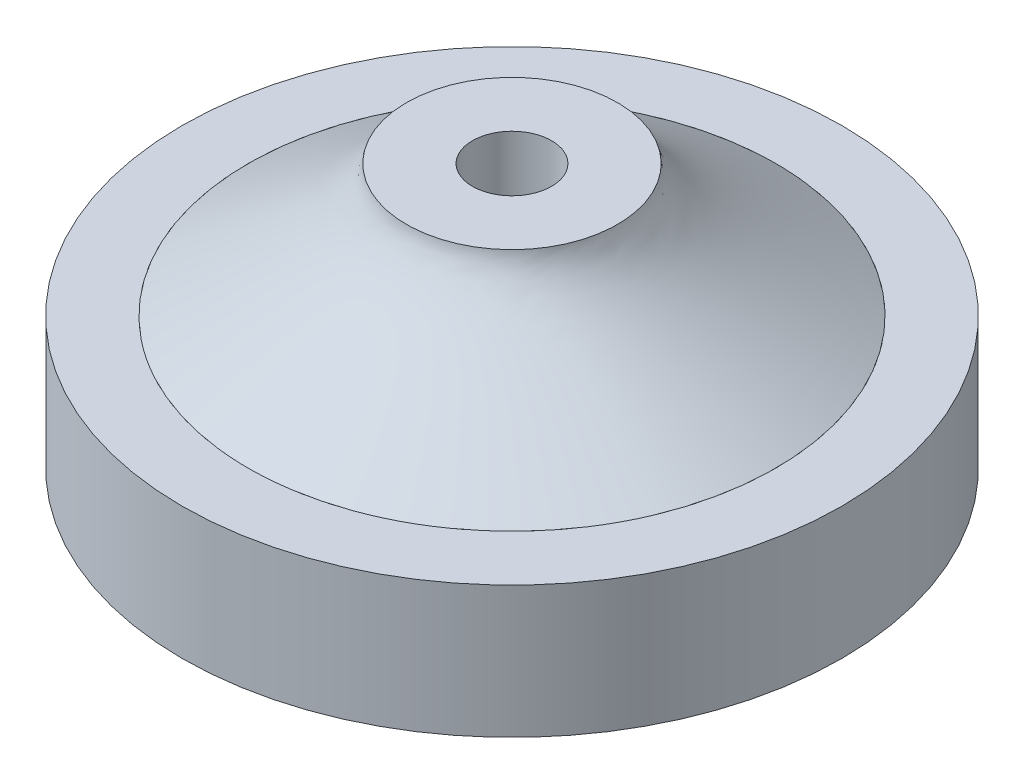
ISO-10303-21;
HEADER;
FILE_DESCRIPTION(('STEP AP214'),'2;1');
FILE_NAME('part.step','',(''),(''),'','','');
FILE_SCHEMA(('AUTOMOTIVE_DESIGN { 1 0 10303 214 1 1 1 1 }'));
ENDSEC;
DATA;
#1=APPLICATION_CONTEXT('core data for automotive mechanical design processes');
#2=APPLICATION_PROTOCOL_DEFINITION('international standard','automotive_design',2000,#1);
#3=PRODUCT_CONTEXT('',#1,'mechanical');
#4=PRODUCT('Part','Part','',(#3));
#5=PRODUCT_RELATED_PRODUCT_CATEGORY('part','',(#4));
#6=PRODUCT_DEFINITION_FORMATION('','',#4);
#7=PRODUCT_DEFINITION_CONTEXT('part definition',#1,'design');
#8=PRODUCT_DEFINITION('design','',#6,#7);
#9=PRODUCT_DEFINITION_SHAPE('','',#8);
#10=(LENGTH_UNIT() NAMED_UNIT(*) SI_UNIT(.MILLI.,.METRE.));
#11=(NAMED_UNIT(*) PLANE_ANGLE_UNIT() SI_UNIT($,.RADIAN.));
#12=(NAMED_UNIT(*) SI_UNIT($,.STERADIAN.) SOLID_ANGLE_UNIT());
#13=UNCERTAINTY_MEASURE_WITH_UNIT(LENGTH_MEASURE(1.E-05),#10,'distance_accuracy_value','');
#14=(GEOMETRIC_REPRESENTATION_CONTEXT(3) GLOBAL_UNCERTAINTY_ASSIGNED_CONTEXT((#13)) GLOBAL_UNIT_ASSIGNED_CONTEXT((#10,
#11,#12)) REPRESENTATION_CONTEXT('',''));
#15=CARTESIAN_POINT('',(0.,0.,0.));
#16=DIRECTION('',(0.,0.,1.));
#17=DIRECTION('',(1.,0.,0.));
#18=AXIS2_PLACEMENT_3D('',#15,#16,#17);
#19=CARTESIAN_POINT('',(0.,3.,0.));
#20=DIRECTION('',(0.,-1.,0.));
#21=DIRECTION('',(0.,0.,-1.));
#22=AXIS2_PLACEMENT_3D('',#19,#20,#21);
#23=CYLINDRICAL_SURFACE('',#22,12.5);
#24=CARTESIAN_POINT('',(0.,3.,0.));
#25=DIRECTION('',(0.,-1.,0.));
#26=DIRECTION('',(0.,0.,-1.));
#27=AXIS2_PLACEMENT_3D('',#24,#25,#26);
#28=CIRCLE('',#27,12.5);
#29=CARTESIAN_POINT('',(0.,3.,-12.5));
#30=VERTEX_POINT('',#29);
#31=EDGE_CURVE('E12',#30,#30,#28,.T.);
#32=ORIENTED_EDGE('',*,*,#31,.T.);
#33=EDGE_LOOP('',(#32));
#34=FACE_BOUND('',#33,.T.);
#35=CARTESIAN_POINT('',(0.,-2.,0.));
#36=DIRECTION('',(0.,-1.,0.));
#37=DIRECTION('',(0.,0.,-1.));
#38=AXIS2_PLACEMENT_3D('',#35,#36,#37);
#39=CIRCLE('',#38,12.5);
#40=CARTESIAN_POINT('',(0.,-2.,-12.5));
#41=VERTEX_POINT('',#40);
#42=EDGE_CURVE('E58',#41,#41,#39,.T.);
#43=ORIENTED_EDGE('',*,*,#42,.F.);
#44=EDGE_LOOP('',(#43));
#45=FACE_BOUND('',#44,.T.);
#46=ADVANCED_FACE('F48',(#34,#45),#23,.T.);
#47=CARTESIAN_POINT('',(0.,3.,0.));
#48=DIRECTION('',(0.,-1.,0.));
#49=DIRECTION('',(0.,0.,-1.));
#50=AXIS2_PLACEMENT_3D('',#47,#48,#49);
#51=PLANE('',#50);
#52=CARTESIAN_POINT('',(0.,3.,0.));
#53=DIRECTION('',(0.,-1.,0.));
#54=DIRECTION('',(0.,0.,-1.));
#55=AXIS2_PLACEMENT_3D('',#52,#53,#54);
#56=CIRCLE('',#55,10.);
#57=CARTESIAN_POINT('',(0.,3.,-10.));
#58=VERTEX_POINT('',#57);
#59=EDGE_CURVE('E54',#58,#58,#56,.T.);
#60=ORIENTED_EDGE('',*,*,#59,.T.);
#61=EDGE_LOOP('',(#60));
#62=FACE_BOUND('',#61,.T.);
#63=ORIENTED_EDGE('',*,*,#31,.F.);
#64=EDGE_LOOP('',(#63));
#65=FACE_BOUND('',#64,.T.);
#66=ADVANCED_FACE('F77',(#62,#65),#51,.F.);
#67=CARTESIAN_POINT('',(0.,3.,0.));
#68=DIRECTION('',(0.,-1.,0.));
#69=DIRECTION('',(0.,0.,-1.));
#70=AXIS2_PLACEMENT_3D('',#67,#68,#69);
#71=CYLINDRICAL_SURFACE('',#70,10.);
#72=ORIENTED_EDGE('',*,*,#59,.F.);
#73=EDGE_LOOP('',(#72));
#74=FACE_BOUND('',#73,.T.);
#75=CARTESIAN_POINT('',(0.,-2.,0.));
#76=DIRECTION('',(0.,-1.,0.));
#77=DIRECTION('',(0.,0.,-1.));
#78=AXIS2_PLACEMENT_3D('',#75,#76,#77);
#79=CIRCLE('',#78,10.);
#80=CARTESIAN_POINT('',(0.,-2.,-10.));
#81=VERTEX_POINT('',#80);
#82=EDGE_CURVE('E62',#81,#81,#79,.T.);
#83=ORIENTED_EDGE('',*,*,#82,.T.);
#84=EDGE_LOOP('',(#83));
#85=FACE_BOUND('',#84,.T.);
#86=ADVANCED_FACE('F68',(#74,#85),#71,.F.);
#87=CARTESIAN_POINT('',(0.,-2.,0.));
#88=DIRECTION('',(0.,-1.,0.));
#89=DIRECTION('',(0.,0.,-1.));
#90=AXIS2_PLACEMENT_3D('',#87,#88,#89);
#91=PLANE('',#90);
#92=ORIENTED_EDGE('',*,*,#42,.T.);
#93=EDGE_LOOP('',(#92));
#94=FACE_BOUND('',#93,.T.);
#95=ORIENTED_EDGE('',*,*,#82,.F.);
#96=EDGE_LOOP('',(#95));
#97=FACE_BOUND('',#96,.T.);
#98=ADVANCED_FACE('F70',(#94,#97),#91,.T.);
#99=CLOSED_SHELL('',(#46,#66,#86,#98));
#100=MANIFOLD_SOLID_BREP('B2',#99);
#101=CARTESIAN_POINT('',(0.,3.,0.));
#102=DIRECTION('',(0.,-1.,0.));
#103=DIRECTION('',(0.,0.,-1.));
#104=AXIS2_PLACEMENT_3D('',#101,#102,#103);
#105=CYLINDRICAL_SURFACE('',#104,10.);
#106=CARTESIAN_POINT('',(0.,3.,0.));
#107=DIRECTION('',(0.,-1.,0.));
#108=DIRECTION('',(0.,0.,-1.));
#109=AXIS2_PLACEMENT_3D('',#106,#107,#108);
#110=CIRCLE('',#109,10.);
#111=CARTESIAN_POINT('',(-2.4625478930264,3.,-9.6920512727983));
#112=VERTEX_POINT('',#111);
#113=EDGE_CURVE('E47',#112,#112,#110,.F.);
#114=ORIENTED_EDGE('',*,*,#113,.F.);
#115=EDGE_LOOP('',(#114));
#116=FACE_BOUND('',#115,.T.);
#117=CARTESIAN_POINT('',(0.,0.,0.));
#118=DIRECTION('',(0.,1.,0.));
#119=DIRECTION('',(0.,0.,1.));
#120=AXIS2_PLACEMENT_3D('',#117,#118,#119);
#121=CIRCLE('',#120,10.);
#122=CARTESIAN_POINT('',(0.,0.,10.));
#123=VERTEX_POINT('',#122);
#124=EDGE_CURVE('E116',#123,#123,#121,.T.);
#125=ORIENTED_EDGE('',*,*,#124,.T.);
#126=EDGE_LOOP('',(#125));
#127=FACE_BOUND('',#126,.T.);
#128=ADVANCED_FACE('F109',(#116,#127),#105,.T.);
#129=CARTESIAN_POINT('',(0.,0.,0.));
#130=DIRECTION('',(0.,1.,0.));
#131=DIRECTION('',(0.,0.,1.));
#132=AXIS2_PLACEMENT_3D('',#129,#130,#131);
#133=PLANE('',#132);
#134=ORIENTED_EDGE('',*,*,#124,.F.);
#135=EDGE_LOOP('',(#134));
#136=FACE_BOUND('',#135,.T.);
#137=ADVANCED_FACE('F144',(#136),#133,.F.);
#138=CARTESIAN_POINT('',(0.,8.,0.));
#139=DIRECTION('',(0.,1.,0.));
#140=DIRECTION('',(0.,0.,1.));
#141=AXIS2_PLACEMENT_3D('',#138,#139,#140);
#142=PLANE('',#141);
#143=CARTESIAN_POINT('',(0.,8.,0.));
#144=DIRECTION('',(0.,1.,0.));
#145=DIRECTION('',(0.,0.,1.));
#146=AXIS2_PLACEMENT_3D('',#143,#144,#145);
#147=CIRCLE('',#146,1.5);
#148=CARTESIAN_POINT('',(0.,8.,1.5));
#149=VERTEX_POINT('',#148);
#150=EDGE_CURVE('E168',#149,#149,#147,.T.);
#151=ORIENTED_EDGE('',*,*,#150,.F.);
#152=EDGE_LOOP('',(#151));
#153=FACE_BOUND('',#152,.T.);
#154=CARTESIAN_POINT('',(0.,8.,0.));
#155=DIRECTION('',(0.,1.,0.));
#156=DIRECTION('',(0.,0.,1.));
#157=AXIS2_PLACEMENT_3D('',#154,#155,#156);
#158=CIRCLE('',#157,4.);
#159=CARTESIAN_POINT('',(-3.89006562599169,8.,-0.931337439104562));
#160=VERTEX_POINT('',#159);
#161=EDGE_CURVE('E120',#160,#160,#158,.T.);
#162=ORIENTED_EDGE('',*,*,#161,.T.);
#163=EDGE_LOOP('',(#162));
#164=FACE_BOUND('',#163,.T.);
#165=ADVANCED_FACE('F133',(#153,#164),#142,.T.);
#166=CARTESIAN_POINT('',(-3.89006562599169,8.,-0.931337439104562));
#167=CARTESIAN_POINT('',(-2.4625478930264,3.,-9.6920512727983));
#168=CARTESIAN_POINT('',(-2.02739074778257,8.,-8.71146869108795));
#169=CARTESIAN_POINT('',(16.9215546525702,3.,-14.6171470588511));
#170=CARTESIAN_POINT('',(5.75274050420082,8.,-6.84879381287883));
#171=CARTESIAN_POINT('',(21.846650438623,3.,4.76695548674551));
#172=CARTESIAN_POINT('',(3.89006562599169,8.,0.931337439104561));
#173=CARTESIAN_POINT('',(2.4625478930264,3.,9.6920512727983));
#174=CARTESIAN_POINT('',(2.02739074778257,8.,8.71146869108795));
#175=CARTESIAN_POINT('',(-16.9215546525702,3.,14.6171470588511));
#176=CARTESIAN_POINT('',(-5.75274050420082,8.,6.84879381287883));
#177=CARTESIAN_POINT('',(-21.846650438623,3.,-4.76695548674551));
#178=CARTESIAN_POINT('',(-3.89006562599169,8.,-0.931337439104562));
#179=CARTESIAN_POINT('',(-2.4625478930264,3.,-9.6920512727983));
#180=(BOUNDED_SURFACE() B_SPLINE_SURFACE(3,1,((#166,#167),(#168,#169),(#170,#171),(#172,#173),
(#174,#175),(#176,#177),(#178,#179)),.UNSPECIFIED.,.T.,.F.,.F.) B_SPLINE_SURFACE_WITH_KNOTS((4,
3,4),(2,2),(0.,0.5,1.),(0.,1.),
.UNSPECIFIED.) GEOMETRIC_REPRESENTATION_ITEM() RATIONAL_B_SPLINE_SURFACE(((1.,1.),
(0.333333333333333,0.333333333333333),(0.333333333333333,0.333333333333333),(1.,1.),
(0.333333333333333,0.333333333333334),(0.333333333333333,0.333333333333334),(1.,1.))) REPRESENTATION_ITEM('') SURFACE());
#181=CARTESIAN_POINT('',(-3.89006562599169,8.,-0.931337439104562));
#182=CARTESIAN_POINT('',(-3.87519564960664,7.94791666666667,-1.0225948748722));
#183=CARTESIAN_POINT('',(-3.86032567322158,7.89583333333333,-1.11385231063985));
#184=CARTESIAN_POINT('',(-3.83058572045147,7.79166666666667,-1.29636718217513));
#185=CARTESIAN_POINT('',(-3.81571574406642,7.73958333333333,-1.38762461794278));
#186=CARTESIAN_POINT('',(-3.78597579129631,7.63541666666667,-1.57013948947806));
#187=CARTESIAN_POINT('',(-3.77110581491125,7.58333333333333,-1.66139692524571));
#188=CARTESIAN_POINT('',(-3.74136586214114,7.47916666666667,-1.84391179678099));
#189=CARTESIAN_POINT('',(-3.72649588575609,7.42708333333333,-1.93516923254864));
#190=CARTESIAN_POINT('',(-3.69675593298598,7.32291666666667,-2.11768410408392));
#191=CARTESIAN_POINT('',(-3.68188595660092,7.27083333333333,-2.20894153985157));
#192=CARTESIAN_POINT('',(-3.65214600383081,7.16666666666667,-2.39145641138685));
#193=CARTESIAN_POINT('',(-3.63727602744576,7.11458333333333,-2.48271384715449));
#194=CARTESIAN_POINT('',(-3.60753607467565,7.01041666666667,-2.66522871868978));
#195=CARTESIAN_POINT('',(-3.59266609829059,6.95833333333333,-2.75648615445742));
#196=CARTESIAN_POINT('',(-3.56292614552048,6.85416666666667,-2.93900102599271));
#197=CARTESIAN_POINT('',(-3.54805616913543,6.80208333333333,-3.03025846176035));
#198=CARTESIAN_POINT('',(-3.51831621636532,6.69791666666667,-3.21277333329564));
#199=CARTESIAN_POINT('',(-3.50344623998026,6.64583333333333,-3.30403076906328));
#200=CARTESIAN_POINT('',(-3.47370628721015,6.54166666666667,-3.48654564059857));
#201=CARTESIAN_POINT('',(-3.45883631082509,6.48958333333333,-3.57780307636621));
#202=CARTESIAN_POINT('',(-3.42909635805498,6.38541666666667,-3.7603179479015));
#203=CARTESIAN_POINT('',(-3.41422638166993,6.33333333333333,-3.85157538366914));
#204=CARTESIAN_POINT('',(-3.38448642889982,6.22916666666667,-4.03409025520443));
#205=CARTESIAN_POINT('',(-3.36961645251476,6.17708333333333,-4.12534769097207));
#206=CARTESIAN_POINT('',(-3.33987649974465,6.07291666666667,-4.30786256250736));
#207=CARTESIAN_POINT('',(-3.3250065233596,6.02083333333333,-4.399119998275));
#208=CARTESIAN_POINT('',(-3.29526657058949,5.91666666666667,-4.58163486981029));
#209=CARTESIAN_POINT('',(-3.28039659420443,5.86458333333333,-4.67289230557793));
#210=CARTESIAN_POINT('',(-3.25065664143432,5.76041666666667,-4.85540717711322));
#211=CARTESIAN_POINT('',(-3.23578666504927,5.70833333333333,-4.94666461288086));
#212=CARTESIAN_POINT('',(-3.20604671227916,5.60416666666667,-5.12917948441615));
#213=CARTESIAN_POINT('',(-3.1911767358941,5.55208333333333,-5.22043692018379));
#214=CARTESIAN_POINT('',(-3.16143678312399,5.44791666666667,-5.40295179171908));
#215=CARTESIAN_POINT('',(-3.14656680673894,5.39583333333333,-5.49420922748672));
#216=CARTESIAN_POINT('',(-3.11682685396883,5.29166666666667,-5.676724099022));
#217=CARTESIAN_POINT('',(-3.10195687758377,5.23958333333333,-5.76798153478965));
#218=CARTESIAN_POINT('',(-3.07221692481366,5.13541666666667,-5.95049640632493));
#219=CARTESIAN_POINT('',(-3.0573469484286,5.08333333333333,-6.04175384209258));
#220=CARTESIAN_POINT('',(-3.02760699565849,4.97916666666667,-6.22426871362786));
#221=CARTESIAN_POINT('',(-3.01273701927344,4.92708333333333,-6.31552614939551));
#222=CARTESIAN_POINT('',(-2.98299706650333,4.82291666666667,-6.49804102093079));
#223=CARTESIAN_POINT('',(-2.96812709011827,4.77083333333333,-6.58929845669844));
#224=CARTESIAN_POINT('',(-2.93838713734816,4.66666666666667,-6.77181332823372));
#225=CARTESIAN_POINT('',(-2.92351716096311,4.61458333333333,-6.86307076400137));
#226=CARTESIAN_POINT('',(-2.893777208193,4.51041666666667,-7.04558563553665));
#227=CARTESIAN_POINT('',(-2.87890723180794,4.45833333333333,-7.1368430713043));
#228=CARTESIAN_POINT('',(-2.84916727903783,4.35416666666667,-7.31935794283958));
#229=CARTESIAN_POINT('',(-2.83429730265278,4.30208333333333,-7.41061537860722));
#230=CARTESIAN_POINT('',(-2.80455734988267,4.19791666666667,-7.59313025014251));
#231=CARTESIAN_POINT('',(-2.78968737349761,4.14583333333333,-7.68438768591015));
#232=CARTESIAN_POINT('',(-2.7599474207275,4.04166666666667,-7.86690255744544));
#233=CARTESIAN_POINT('',(-2.74507744434245,3.98958333333333,-7.95815999321308));
#234=CARTESIAN_POINT('',(-2.71533749157233,3.88541666666667,-8.14067486474837));
#235=CARTESIAN_POINT('',(-2.70046751518728,3.83333333333333,-8.23193230051601));
#236=CARTESIAN_POINT('',(-2.67072756241717,3.72916666666667,-8.4144471720513));
#237=CARTESIAN_POINT('',(-2.65585758603211,3.67708333333333,-8.50570460781894));
#238=CARTESIAN_POINT('',(-2.626117633262,3.57291666666667,-8.68821947935423));
#239=CARTESIAN_POINT('',(-2.61124765687695,3.52083333333333,-8.77947691512187));
#240=CARTESIAN_POINT('',(-2.58150770410684,3.41666666666667,-8.96199178665716));
#241=CARTESIAN_POINT('',(-2.56663772772178,3.36458333333333,-9.0532492224248));
#242=CARTESIAN_POINT('',(-2.53689777495167,3.26041666666667,-9.23576409396009));
#243=CARTESIAN_POINT('',(-2.52202779856662,3.20833333333333,-9.32702152972773));
#244=CARTESIAN_POINT('',(-2.49228784579651,3.10416666666667,-9.50953640126302));
#245=CARTESIAN_POINT('',(-2.47741786941145,3.05208333333333,-9.60079383703066));
#246=CARTESIAN_POINT('',(-2.4625478930264,3.,-9.6920512727983));
#247=B_SPLINE_CURVE_WITH_KNOTS('',3,(#181,#182,#183,#184,#185,#186,#187,#188,#189,#190,#191,
#192,#193,#194,#195,#196,#197,#198,#199,#200,#201,#202,#203,#204,#205,#206,#207,#208,#209,#210,
#211,#212,#213,#214,#215,#216,#217,#218,#219,#220,#221,#222,#223,#224,#225,#226,#227,#228,#229,
#230,#231,#232,#233,#234,#235,#236,#237,#238,#239,#240,#241,#242,#243,#244,#245,#246),
.UNSPECIFIED.,.F.,.F.,(4,2,2,2,2,2,2,2,2,2,2,2,2,2,2,2,2,2,2,2,2,2,2,2,2,2,2,2,2,2,2,2,4),(0.,
0.31836360427222,0.63672720854444,0.955090812816659,1.27345441708888,1.5918180213611,
1.91018162563332,2.22854522990554,2.54690883417776,2.86527243844998,3.1836360427222,
3.50199964699442,3.82036325126664,4.13872685553886,4.45709045981108,4.7754540640833,
5.09381766835552,5.41218127262774,5.73054487689996,6.04890848117217,6.36727208544439,
6.68563568971661,7.00399929398883,7.32236289826105,7.64072650253327,7.95909010680549,
8.27745371107771,8.59581731534993,8.91418091962215,9.23254452389437,9.55090812816659,
9.86927173243881,10.187635336711),.UNSPECIFIED.);
#248=EDGE_CURVE('BSEAM143',#160,#112,#247,.T.);
#249=ORIENTED_EDGE('',*,*,#161,.F.);
#250=ORIENTED_EDGE('',*,*,#113,.T.);
#251=ORIENTED_EDGE('',*,*,#248,.T.);
#252=ORIENTED_EDGE('',*,*,#248,.F.);
#253=EDGE_LOOP('',(#249,#251,#250,#252));
#254=FACE_BOUND('',#253,.T.);
#255=ADVANCED_FACE('F143',(#254),#180,.T.);
#256=CARTESIAN_POINT('',(0.,3.,0.));
#257=DIRECTION('',(0.,1.,0.));
#258=DIRECTION('',(0.,0.,1.));
#259=AXIS2_PLACEMENT_3D('',#256,#257,#258);
#260=CYLINDRICAL_SURFACE('',#259,1.5);
#261=CARTESIAN_POINT('',(0.,3.,0.));
#262=DIRECTION('',(0.,1.,0.));
#263=DIRECTION('',(0.,0.,1.));
#264=AXIS2_PLACEMENT_3D('',#261,#262,#263);
#265=CIRCLE('',#264,1.5);
#266=CARTESIAN_POINT('',(0.,3.,1.5));
#267=VERTEX_POINT('',#266);
#268=EDGE_CURVE('E127',#267,#267,#265,.T.);
#269=ORIENTED_EDGE('',*,*,#268,.F.);
#270=EDGE_LOOP('',(#269));
#271=FACE_BOUND('',#270,.T.);
#272=ORIENTED_EDGE('',*,*,#150,.T.);
#273=EDGE_LOOP('',(#272));
#274=FACE_BOUND('',#273,.T.);
#275=ADVANCED_FACE('F146',(#271,#274),#260,.F.);
#276=CARTESIAN_POINT('',(0.,3.,0.));
#277=DIRECTION('',(0.,1.,0.));
#278=DIRECTION('',(0.,0.,1.));
#279=AXIS2_PLACEMENT_3D('',#276,#277,#278);
#280=PLANE('',#279);
#281=ORIENTED_EDGE('',*,*,#268,.T.);
#282=EDGE_LOOP('',(#281));
#283=FACE_BOUND('',#282,.T.);
#284=ADVANCED_FACE('F174',(#283),#280,.T.);
#285=CLOSED_SHELL('',(#128,#137,#165,#255,#275,#284));
#286=MANIFOLD_SOLID_BREP('B7',#285);
#287=ADVANCED_BREP_SHAPE_REPRESENTATION('',(#18,#100,#286),#14);
#288=SHAPE_DEFINITION_REPRESENTATION(#9,#287);
ENDSEC;
END-ISO-10303-21;
